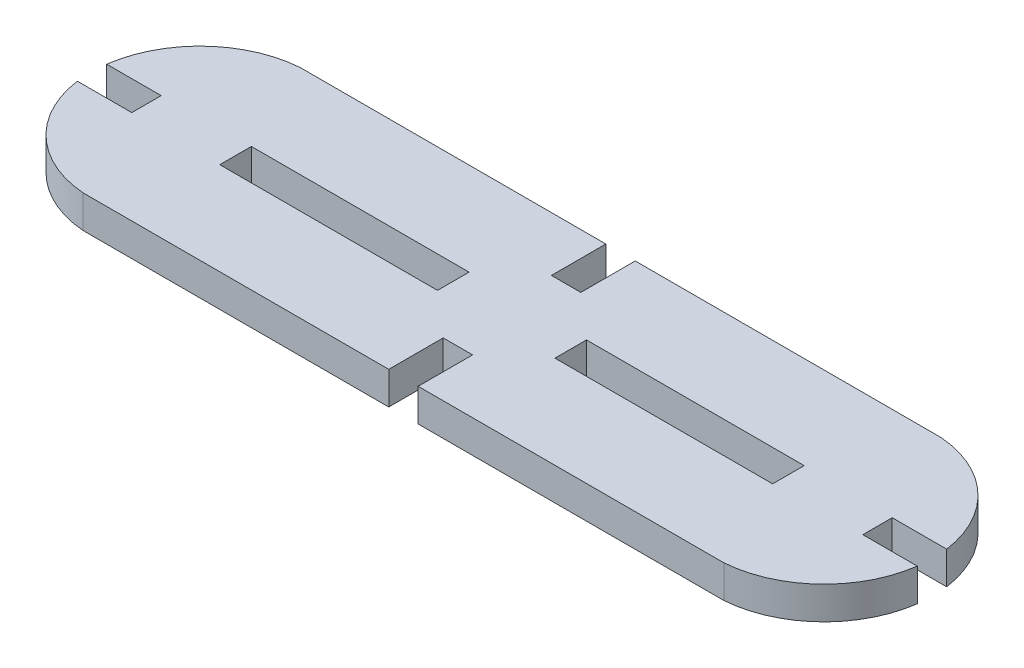
ISO-10303-21;
HEADER;
FILE_DESCRIPTION(('STEP AP214'),'2;1');
FILE_NAME('part.step','',(''),(''),'','','');
FILE_SCHEMA(('AUTOMOTIVE_DESIGN { 1 0 10303 214 1 1 1 1 }'));
ENDSEC;
DATA;
#1=APPLICATION_CONTEXT('core data for automotive mechanical design processes');
#2=APPLICATION_PROTOCOL_DEFINITION('international standard','automotive_design',2000,#1);
#3=PRODUCT_CONTEXT('',#1,'mechanical');
#4=PRODUCT('Part','Part','',(#3));
#5=PRODUCT_RELATED_PRODUCT_CATEGORY('part','',(#4));
#6=PRODUCT_DEFINITION_FORMATION('','',#4);
#7=PRODUCT_DEFINITION_CONTEXT('part definition',#1,'design');
#8=PRODUCT_DEFINITION('design','',#6,#7);
#9=PRODUCT_DEFINITION_SHAPE('','',#8);
#10=(LENGTH_UNIT() NAMED_UNIT(*) SI_UNIT(.MILLI.,.METRE.));
#11=(NAMED_UNIT(*) PLANE_ANGLE_UNIT() SI_UNIT($,.RADIAN.));
#12=(NAMED_UNIT(*) SI_UNIT($,.STERADIAN.) SOLID_ANGLE_UNIT());
#13=UNCERTAINTY_MEASURE_WITH_UNIT(LENGTH_MEASURE(1.E-05),#10,'distance_accuracy_value','');
#14=(GEOMETRIC_REPRESENTATION_CONTEXT(3) GLOBAL_UNCERTAINTY_ASSIGNED_CONTEXT((#13)) GLOBAL_UNIT_ASSIGNED_CONTEXT((#10,
#11,#12)) REPRESENTATION_CONTEXT('',''));
#15=CARTESIAN_POINT('',(0.,0.,0.));
#16=DIRECTION('',(0.,0.,1.));
#17=DIRECTION('',(1.,0.,0.));
#18=AXIS2_PLACEMENT_3D('',#15,#16,#17);
#19=CARTESIAN_POINT('',(8.10539415150254,3.,-20.0294275253098));
#20=DIRECTION('',(0.,-1.,0.));
#21=DIRECTION('',(0.,0.,-1.));
#22=AXIS2_PLACEMENT_3D('',#19,#20,#21);
#23=CYLINDRICAL_SURFACE('',#22,10.);
#24=CARTESIAN_POINT('',(8.10539415150254,0.,-20.0294275253098));
#25=DIRECTION('',(0.,1.,0.));
#26=DIRECTION('',(0.,0.,-1.));
#27=AXIS2_PLACEMENT_3D('',#24,#25,#26);
#28=CIRCLE('',#27,10.);
#29=CARTESIAN_POINT('',(18.0138501361653,0.,-21.3794275253098));
#30=VERTEX_POINT('',#29);
#31=CARTESIAN_POINT('',(8.87199999999997,0.,-30.));
#32=VERTEX_POINT('',#31);
#33=EDGE_CURVE('E227',#30,#32,#28,.T.);
#34=ORIENTED_EDGE('',*,*,#33,.T.);
#35=DIRECTION('',(0.,-1.,0.));
#36=VECTOR('',#35,1.);
#37=CARTESIAN_POINT('',(8.87199999999997,3.,-30.));
#38=LINE('',#37,#36);
#39=CARTESIAN_POINT('',(8.87199999999997,3.,-30.));
#40=VERTEX_POINT('',#39);
#41=EDGE_CURVE('E11',#40,#32,#38,.T.);
#42=ORIENTED_EDGE('',*,*,#41,.F.);
#43=CARTESIAN_POINT('',(8.10539415150254,3.,-20.0294275253098));
#44=DIRECTION('',(0.,1.,0.));
#45=DIRECTION('',(0.,0.,-1.));
#46=AXIS2_PLACEMENT_3D('',#43,#44,#45);
#47=CIRCLE('',#46,10.);
#48=CARTESIAN_POINT('',(18.0138501361653,3.,-21.3794275253098));
#49=VERTEX_POINT('',#48);
#50=EDGE_CURVE('E286',#49,#40,#47,.T.);
#51=ORIENTED_EDGE('',*,*,#50,.F.);
#52=DIRECTION('',(0.,-1.,0.));
#53=VECTOR('',#52,1.);
#54=CARTESIAN_POINT('',(18.0138501361653,3.,-21.3794275253098));
#55=LINE('',#54,#53);
#56=EDGE_CURVE('E328',#49,#30,#55,.T.);
#57=ORIENTED_EDGE('',*,*,#56,.T.);
#58=EDGE_LOOP('',(#34,#42,#51,#57));
#59=FACE_BOUND('',#58,.T.);
#60=ADVANCED_FACE('F32',(#59),#23,.T.);
#61=CARTESIAN_POINT('',(8.87199999999997,3.,-30.));
#62=DIRECTION('',(0.,0.,1.));
#63=DIRECTION('',(1.,0.,0.));
#64=AXIS2_PLACEMENT_3D('',#61,#62,#63);
#65=PLANE('',#64);
#66=DIRECTION('',(-1.,0.,0.));
#67=VECTOR('',#66,1.);
#68=CARTESIAN_POINT('',(8.87199999999997,0.,-30.));
#69=LINE('',#68,#67);
#70=CARTESIAN_POINT('',(-19.214,0.,-30.));
#71=VERTEX_POINT('',#70);
#72=EDGE_CURVE('E331',#32,#71,#69,.T.);
#73=ORIENTED_EDGE('',*,*,#72,.T.);
#74=DIRECTION('',(0.,-1.,0.));
#75=VECTOR('',#74,1.);
#76=CARTESIAN_POINT('',(-19.214,3.,-30.));
#77=LINE('',#76,#75);
#78=CARTESIAN_POINT('',(-19.214,3.,-30.));
#79=VERTEX_POINT('',#78);
#80=EDGE_CURVE('E39',#79,#71,#77,.T.);
#81=ORIENTED_EDGE('',*,*,#80,.F.);
#82=DIRECTION('',(-1.,0.,0.));
#83=VECTOR('',#82,1.);
#84=CARTESIAN_POINT('',(8.87199999999997,3.,-30.));
#85=LINE('',#84,#83);
#86=EDGE_CURVE('E289',#40,#79,#85,.T.);
#87=ORIENTED_EDGE('',*,*,#86,.F.);
#88=ORIENTED_EDGE('',*,*,#41,.T.);
#89=EDGE_LOOP('',(#73,#81,#87,#88));
#90=FACE_BOUND('',#89,.T.);
#91=ADVANCED_FACE('F447',(#90),#65,.F.);
#92=CARTESIAN_POINT('',(-19.214,3.,-25.));
#93=DIRECTION('',(1.,0.,0.));
#94=DIRECTION('',(0.,0.,-1.));
#95=AXIS2_PLACEMENT_3D('',#92,#93,#94);
#96=PLANE('',#95);
#97=DIRECTION('',(0.,0.,1.));
#98=VECTOR('',#97,1.);
#99=CARTESIAN_POINT('',(-19.214,0.,-25.));
#100=LINE('',#99,#98);
#101=CARTESIAN_POINT('',(-19.214,0.,-25.));
#102=VERTEX_POINT('',#101);
#103=EDGE_CURVE('E333',#71,#102,#100,.T.);
#104=ORIENTED_EDGE('',*,*,#103,.T.);
#105=DIRECTION('',(0.,-1.,0.));
#106=VECTOR('',#105,1.);
#107=CARTESIAN_POINT('',(-19.214,3.,-25.));
#108=LINE('',#107,#106);
#109=CARTESIAN_POINT('',(-19.214,3.,-25.));
#110=VERTEX_POINT('',#109);
#111=EDGE_CURVE('E418',#110,#102,#108,.T.);
#112=ORIENTED_EDGE('',*,*,#111,.F.);
#113=DIRECTION('',(0.,0.,1.));
#114=VECTOR('',#113,1.);
#115=CARTESIAN_POINT('',(-19.214,3.,-25.));
#116=LINE('',#115,#114);
#117=EDGE_CURVE('E292',#79,#110,#116,.T.);
#118=ORIENTED_EDGE('',*,*,#117,.F.);
#119=ORIENTED_EDGE('',*,*,#80,.T.);
#120=EDGE_LOOP('',(#104,#112,#118,#119));
#121=FACE_BOUND('',#120,.T.);
#122=ADVANCED_FACE('F425',(#121),#96,.F.);
#123=CARTESIAN_POINT('',(-21.914,3.,-25.));
#124=DIRECTION('',(0.,0.,1.));
#125=DIRECTION('',(1.,0.,0.));
#126=AXIS2_PLACEMENT_3D('',#123,#124,#125);
#127=PLANE('',#126);
#128=DIRECTION('',(-1.,0.,0.));
#129=VECTOR('',#128,1.);
#130=CARTESIAN_POINT('',(-21.914,0.,-25.));
#131=LINE('',#130,#129);
#132=CARTESIAN_POINT('',(-21.914,0.,-25.));
#133=VERTEX_POINT('',#132);
#134=EDGE_CURVE('E335',#102,#133,#131,.T.);
#135=ORIENTED_EDGE('',*,*,#134,.T.);
#136=DIRECTION('',(0.,-1.,0.));
#137=VECTOR('',#136,1.);
#138=CARTESIAN_POINT('',(-21.914,3.,-25.));
#139=LINE('',#138,#137);
#140=CARTESIAN_POINT('',(-21.914,3.,-25.));
#141=VERTEX_POINT('',#140);
#142=EDGE_CURVE('E415',#141,#133,#139,.T.);
#143=ORIENTED_EDGE('',*,*,#142,.F.);
#144=DIRECTION('',(-1.,0.,0.));
#145=VECTOR('',#144,1.);
#146=CARTESIAN_POINT('',(-21.914,3.,-25.));
#147=LINE('',#146,#145);
#148=EDGE_CURVE('E294',#110,#141,#147,.T.);
#149=ORIENTED_EDGE('',*,*,#148,.F.);
#150=ORIENTED_EDGE('',*,*,#111,.T.);
#151=EDGE_LOOP('',(#135,#143,#149,#150));
#152=FACE_BOUND('',#151,.T.);
#153=ADVANCED_FACE('F435',(#152),#127,.F.);
#154=CARTESIAN_POINT('',(-21.914,3.,-30.));
#155=DIRECTION('',(-1.,0.,0.));
#156=DIRECTION('',(0.,0.,1.));
#157=AXIS2_PLACEMENT_3D('',#154,#155,#156);
#158=PLANE('',#157);
#159=DIRECTION('',(0.,0.,-1.));
#160=VECTOR('',#159,1.);
#161=CARTESIAN_POINT('',(-21.914,0.,-30.));
#162=LINE('',#161,#160);
#163=CARTESIAN_POINT('',(-21.914,0.,-30.));
#164=VERTEX_POINT('',#163);
#165=EDGE_CURVE('E337',#133,#164,#162,.T.);
#166=ORIENTED_EDGE('',*,*,#165,.T.);
#167=DIRECTION('',(0.,-1.,0.));
#168=VECTOR('',#167,1.);
#169=CARTESIAN_POINT('',(-21.914,3.,-30.));
#170=LINE('',#169,#168);
#171=CARTESIAN_POINT('',(-21.914,3.,-30.));
#172=VERTEX_POINT('',#171);
#173=EDGE_CURVE('E412',#172,#164,#170,.T.);
#174=ORIENTED_EDGE('',*,*,#173,.F.);
#175=DIRECTION('',(0.,0.,-1.));
#176=VECTOR('',#175,1.);
#177=CARTESIAN_POINT('',(-21.914,3.,-30.));
#178=LINE('',#177,#176);
#179=EDGE_CURVE('E296',#141,#172,#178,.T.);
#180=ORIENTED_EDGE('',*,*,#179,.F.);
#181=ORIENTED_EDGE('',*,*,#142,.T.);
#182=EDGE_LOOP('',(#166,#174,#180,#181));
#183=FACE_BOUND('',#182,.T.);
#184=ADVANCED_FACE('F439',(#183),#158,.F.);
#185=CARTESIAN_POINT('',(-50.,3.,-30.));
#186=DIRECTION('',(0.,0.,1.));
#187=DIRECTION('',(1.,0.,0.));
#188=AXIS2_PLACEMENT_3D('',#185,#186,#187);
#189=PLANE('',#188);
#190=DIRECTION('',(-1.,0.,0.));
#191=VECTOR('',#190,1.);
#192=CARTESIAN_POINT('',(-50.,0.,-30.));
#193=LINE('',#192,#191);
#194=CARTESIAN_POINT('',(-50.,0.,-30.));
#195=VERTEX_POINT('',#194);
#196=EDGE_CURVE('E339',#164,#195,#193,.T.);
#197=ORIENTED_EDGE('',*,*,#196,.T.);
#198=DIRECTION('',(0.,-1.,0.));
#199=VECTOR('',#198,1.);
#200=CARTESIAN_POINT('',(-50.,3.,-30.));
#201=LINE('',#200,#199);
#202=CARTESIAN_POINT('',(-50.,3.,-30.));
#203=VERTEX_POINT('',#202);
#204=EDGE_CURVE('E409',#203,#195,#201,.T.);
#205=ORIENTED_EDGE('',*,*,#204,.F.);
#206=DIRECTION('',(-1.,0.,0.));
#207=VECTOR('',#206,1.);
#208=CARTESIAN_POINT('',(-50.,3.,-30.));
#209=LINE('',#208,#207);
#210=EDGE_CURVE('E298',#172,#203,#209,.T.);
#211=ORIENTED_EDGE('',*,*,#210,.F.);
#212=ORIENTED_EDGE('',*,*,#173,.T.);
#213=EDGE_LOOP('',(#197,#205,#211,#212));
#214=FACE_BOUND('',#213,.T.);
#215=ADVANCED_FACE('F520',(#214),#189,.F.);
#216=CARTESIAN_POINT('',(-49.2333941515026,3.,-20.0294275253098));
#217=DIRECTION('',(0.,-1.,0.));
#218=DIRECTION('',(0.,0.,-1.));
#219=AXIS2_PLACEMENT_3D('',#216,#217,#218);
#220=CYLINDRICAL_SURFACE('',#219,10.);
#221=CARTESIAN_POINT('',(-49.2333941515026,0.,-20.0294275253098));
#222=DIRECTION('',(0.,1.,0.));
#223=DIRECTION('',(0.,0.,1.));
#224=AXIS2_PLACEMENT_3D('',#221,#222,#223);
#225=CIRCLE('',#224,10.);
#226=CARTESIAN_POINT('',(-59.1418501361654,0.,-21.3794275253098));
#227=VERTEX_POINT('',#226);
#228=EDGE_CURVE('E341',#195,#227,#225,.T.);
#229=ORIENTED_EDGE('',*,*,#228,.T.);
#230=DIRECTION('',(0.,-1.,0.));
#231=VECTOR('',#230,1.);
#232=CARTESIAN_POINT('',(-59.1418501361654,3.,-21.3794275253098));
#233=LINE('',#232,#231);
#234=CARTESIAN_POINT('',(-59.1418501361654,3.,-21.3794275253098));
#235=VERTEX_POINT('',#234);
#236=EDGE_CURVE('E406',#235,#227,#233,.T.);
#237=ORIENTED_EDGE('',*,*,#236,.F.);
#238=CARTESIAN_POINT('',(-49.2333941515026,3.,-20.0294275253098));
#239=DIRECTION('',(0.,1.,0.));
#240=DIRECTION('',(0.,0.,1.));
#241=AXIS2_PLACEMENT_3D('',#238,#239,#240);
#242=CIRCLE('',#241,10.);
#243=EDGE_CURVE('E300',#203,#235,#242,.T.);
#244=ORIENTED_EDGE('',*,*,#243,.F.);
#245=ORIENTED_EDGE('',*,*,#204,.T.);
#246=EDGE_LOOP('',(#229,#237,#244,#245));
#247=FACE_BOUND('',#246,.T.);
#248=ADVANCED_FACE('F518',(#247),#220,.T.);
#249=CARTESIAN_POINT('',(-54.1418501361654,3.,-21.3794275253098));
#250=DIRECTION('',(0.,0.,-1.));
#251=DIRECTION('',(-1.,0.,0.));
#252=AXIS2_PLACEMENT_3D('',#249,#250,#251);
#253=PLANE('',#252);
#254=DIRECTION('',(1.,0.,0.));
#255=VECTOR('',#254,1.);
#256=CARTESIAN_POINT('',(-54.1418501361654,0.,-21.3794275253098));
#257=LINE('',#256,#255);
#258=CARTESIAN_POINT('',(-54.1418501361654,0.,-21.3794275253098));
#259=VERTEX_POINT('',#258);
#260=EDGE_CURVE('E343',#227,#259,#257,.T.);
#261=ORIENTED_EDGE('',*,*,#260,.T.);
#262=DIRECTION('',(0.,-1.,0.));
#263=VECTOR('',#262,1.);
#264=CARTESIAN_POINT('',(-54.1418501361654,3.,-21.3794275253098));
#265=LINE('',#264,#263);
#266=CARTESIAN_POINT('',(-54.1418501361654,3.,-21.3794275253098));
#267=VERTEX_POINT('',#266);
#268=EDGE_CURVE('E403',#267,#259,#265,.T.);
#269=ORIENTED_EDGE('',*,*,#268,.F.);
#270=DIRECTION('',(1.,0.,0.));
#271=VECTOR('',#270,1.);
#272=CARTESIAN_POINT('',(-54.1418501361654,3.,-21.3794275253098));
#273=LINE('',#272,#271);
#274=EDGE_CURVE('E302',#235,#267,#273,.T.);
#275=ORIENTED_EDGE('',*,*,#274,.F.);
#276=ORIENTED_EDGE('',*,*,#236,.T.);
#277=EDGE_LOOP('',(#261,#269,#275,#276));
#278=FACE_BOUND('',#277,.T.);
#279=ADVANCED_FACE('F513',(#278),#253,.F.);
#280=CARTESIAN_POINT('',(-54.1418501361654,3.,-18.6794275253098));
#281=DIRECTION('',(1.,0.,0.));
#282=DIRECTION('',(0.,0.,-1.));
#283=AXIS2_PLACEMENT_3D('',#280,#281,#282);
#284=PLANE('',#283);
#285=DIRECTION('',(0.,0.,1.));
#286=VECTOR('',#285,1.);
#287=CARTESIAN_POINT('',(-54.1418501361654,0.,-18.6794275253098));
#288=LINE('',#287,#286);
#289=CARTESIAN_POINT('',(-54.1418501361654,0.,-18.6794275253098));
#290=VERTEX_POINT('',#289);
#291=EDGE_CURVE('E345',#259,#290,#288,.T.);
#292=ORIENTED_EDGE('',*,*,#291,.T.);
#293=DIRECTION('',(0.,-1.,0.));
#294=VECTOR('',#293,1.);
#295=CARTESIAN_POINT('',(-54.1418501361654,3.,-18.6794275253098));
#296=LINE('',#295,#294);
#297=CARTESIAN_POINT('',(-54.1418501361654,3.,-18.6794275253098));
#298=VERTEX_POINT('',#297);
#299=EDGE_CURVE('E400',#298,#290,#296,.T.);
#300=ORIENTED_EDGE('',*,*,#299,.F.);
#301=DIRECTION('',(0.,0.,1.));
#302=VECTOR('',#301,1.);
#303=CARTESIAN_POINT('',(-54.1418501361654,3.,-18.6794275253098));
#304=LINE('',#303,#302);
#305=EDGE_CURVE('E304',#267,#298,#304,.T.);
#306=ORIENTED_EDGE('',*,*,#305,.F.);
#307=ORIENTED_EDGE('',*,*,#268,.T.);
#308=EDGE_LOOP('',(#292,#300,#306,#307));
#309=FACE_BOUND('',#308,.T.);
#310=ADVANCED_FACE('F508',(#309),#284,.F.);
#311=CARTESIAN_POINT('',(-54.1418501361654,3.,-18.6794275253098));
#312=DIRECTION('',(0.,0.,1.));
#313=DIRECTION('',(1.,0.,0.));
#314=AXIS2_PLACEMENT_3D('',#311,#312,#313);
#315=PLANE('',#314);
#316=DIRECTION('',(-1.,0.,0.));
#317=VECTOR('',#316,1.);
#318=CARTESIAN_POINT('',(-54.1418501361654,0.,-18.6794275253098));
#319=LINE('',#318,#317);
#320=CARTESIAN_POINT('',(-59.1418501361654,0.,-18.6794275253098));
#321=VERTEX_POINT('',#320);
#322=EDGE_CURVE('E347',#290,#321,#319,.T.);
#323=ORIENTED_EDGE('',*,*,#322,.T.);
#324=DIRECTION('',(0.,-1.,0.));
#325=VECTOR('',#324,1.);
#326=CARTESIAN_POINT('',(-59.1418501361654,3.,-18.6794275253098));
#327=LINE('',#326,#325);
#328=CARTESIAN_POINT('',(-59.1418501361654,3.,-18.6794275253098));
#329=VERTEX_POINT('',#328);
#330=EDGE_CURVE('E397',#329,#321,#327,.T.);
#331=ORIENTED_EDGE('',*,*,#330,.F.);
#332=DIRECTION('',(-1.,0.,0.));
#333=VECTOR('',#332,1.);
#334=CARTESIAN_POINT('',(-54.1418501361654,3.,-18.6794275253098));
#335=LINE('',#334,#333);
#336=EDGE_CURVE('E306',#298,#329,#335,.T.);
#337=ORIENTED_EDGE('',*,*,#336,.F.);
#338=ORIENTED_EDGE('',*,*,#299,.T.);
#339=EDGE_LOOP('',(#323,#331,#337,#338));
#340=FACE_BOUND('',#339,.T.);
#341=ADVANCED_FACE('F504',(#340),#315,.F.);
#342=CARTESIAN_POINT('',(-49.2333941515026,3.,-20.0294275253098));
#343=DIRECTION('',(0.,-1.,0.));
#344=DIRECTION('',(0.,0.,-1.));
#345=AXIS2_PLACEMENT_3D('',#342,#343,#344);
#346=CYLINDRICAL_SURFACE('',#345,10.);
#347=CARTESIAN_POINT('',(-49.2333941515026,0.,-20.0294275253098));
#348=DIRECTION('',(0.,1.,0.));
#349=DIRECTION('',(0.,0.,-1.));
#350=AXIS2_PLACEMENT_3D('',#347,#348,#349);
#351=CIRCLE('',#350,10.);
#352=CARTESIAN_POINT('',(-50.,0.,-10.0588550506196));
#353=VERTEX_POINT('',#352);
#354=EDGE_CURVE('E349',#321,#353,#351,.T.);
#355=ORIENTED_EDGE('',*,*,#354,.T.);
#356=DIRECTION('',(0.,-1.,0.));
#357=VECTOR('',#356,1.);
#358=CARTESIAN_POINT('',(-50.,3.,-10.0588550506196));
#359=LINE('',#358,#357);
#360=CARTESIAN_POINT('',(-50.,3.,-10.0588550506196));
#361=VERTEX_POINT('',#360);
#362=EDGE_CURVE('E394',#361,#353,#359,.T.);
#363=ORIENTED_EDGE('',*,*,#362,.F.);
#364=CARTESIAN_POINT('',(-49.2333941515026,3.,-20.0294275253098));
#365=DIRECTION('',(0.,1.,0.));
#366=DIRECTION('',(0.,0.,-1.));
#367=AXIS2_PLACEMENT_3D('',#364,#365,#366);
#368=CIRCLE('',#367,10.);
#369=EDGE_CURVE('E308',#329,#361,#368,.T.);
#370=ORIENTED_EDGE('',*,*,#369,.F.);
#371=ORIENTED_EDGE('',*,*,#330,.T.);
#372=EDGE_LOOP('',(#355,#363,#370,#371));
#373=FACE_BOUND('',#372,.T.);
#374=ADVANCED_FACE('F499',(#373),#346,.T.);
#375=CARTESIAN_POINT('',(-50.,3.,-10.0588550506196));
#376=DIRECTION('',(0.,0.,-1.));
#377=DIRECTION('',(-1.,0.,0.));
#378=AXIS2_PLACEMENT_3D('',#375,#376,#377);
#379=PLANE('',#378);
#380=DIRECTION('',(1.,0.,0.));
#381=VECTOR('',#380,1.);
#382=CARTESIAN_POINT('',(-50.,0.,-10.0588550506196));
#383=LINE('',#382,#381);
#384=CARTESIAN_POINT('',(-21.914,0.,-10.0588550506196));
#385=VERTEX_POINT('',#384);
#386=EDGE_CURVE('E351',#353,#385,#383,.T.);
#387=ORIENTED_EDGE('',*,*,#386,.T.);
#388=DIRECTION('',(0.,-1.,0.));
#389=VECTOR('',#388,1.);
#390=CARTESIAN_POINT('',(-21.914,3.,-10.0588550506196));
#391=LINE('',#390,#389);
#392=CARTESIAN_POINT('',(-21.914,3.,-10.0588550506196));
#393=VERTEX_POINT('',#392);
#394=EDGE_CURVE('E391',#393,#385,#391,.T.);
#395=ORIENTED_EDGE('',*,*,#394,.F.);
#396=DIRECTION('',(1.,0.,0.));
#397=VECTOR('',#396,1.);
#398=CARTESIAN_POINT('',(-50.,3.,-10.0588550506196));
#399=LINE('',#398,#397);
#400=EDGE_CURVE('E310',#361,#393,#399,.T.);
#401=ORIENTED_EDGE('',*,*,#400,.F.);
#402=ORIENTED_EDGE('',*,*,#362,.T.);
#403=EDGE_LOOP('',(#387,#395,#401,#402));
#404=FACE_BOUND('',#403,.T.);
#405=ADVANCED_FACE('F493',(#404),#379,.F.);
#406=CARTESIAN_POINT('',(-21.914,3.,-10.0588550506196));
#407=DIRECTION('',(-1.,0.,0.));
#408=DIRECTION('',(0.,0.,1.));
#409=AXIS2_PLACEMENT_3D('',#406,#407,#408);
#410=PLANE('',#409);
#411=DIRECTION('',(0.,0.,-1.));
#412=VECTOR('',#411,1.);
#413=CARTESIAN_POINT('',(-21.914,0.,-10.0588550506196));
#414=LINE('',#413,#412);
#415=CARTESIAN_POINT('',(-21.914,0.,-15.0588550506196));
#416=VERTEX_POINT('',#415);
#417=EDGE_CURVE('E353',#385,#416,#414,.T.);
#418=ORIENTED_EDGE('',*,*,#417,.T.);
#419=DIRECTION('',(0.,-1.,0.));
#420=VECTOR('',#419,1.);
#421=CARTESIAN_POINT('',(-21.914,3.,-15.0588550506196));
#422=LINE('',#421,#420);
#423=CARTESIAN_POINT('',(-21.914,3.,-15.0588550506196));
#424=VERTEX_POINT('',#423);
#425=EDGE_CURVE('E388',#424,#416,#422,.T.);
#426=ORIENTED_EDGE('',*,*,#425,.F.);
#427=DIRECTION('',(0.,0.,-1.));
#428=VECTOR('',#427,1.);
#429=CARTESIAN_POINT('',(-21.914,3.,-10.0588550506196));
#430=LINE('',#429,#428);
#431=EDGE_CURVE('E312',#393,#424,#430,.T.);
#432=ORIENTED_EDGE('',*,*,#431,.F.);
#433=ORIENTED_EDGE('',*,*,#394,.T.);
#434=EDGE_LOOP('',(#418,#426,#432,#433));
#435=FACE_BOUND('',#434,.T.);
#436=ADVANCED_FACE('F489',(#435),#410,.F.);
#437=CARTESIAN_POINT('',(-21.914,3.,-15.0588550506196));
#438=DIRECTION('',(0.,0.,-1.));
#439=DIRECTION('',(-1.,0.,0.));
#440=AXIS2_PLACEMENT_3D('',#437,#438,#439);
#441=PLANE('',#440);
#442=DIRECTION('',(1.,0.,0.));
#443=VECTOR('',#442,1.);
#444=CARTESIAN_POINT('',(-21.914,0.,-15.0588550506196));
#445=LINE('',#444,#443);
#446=CARTESIAN_POINT('',(-19.214,0.,-15.0588550506196));
#447=VERTEX_POINT('',#446);
#448=EDGE_CURVE('E355',#416,#447,#445,.T.);
#449=ORIENTED_EDGE('',*,*,#448,.T.);
#450=DIRECTION('',(0.,-1.,0.));
#451=VECTOR('',#450,1.);
#452=CARTESIAN_POINT('',(-19.214,3.,-15.0588550506196));
#453=LINE('',#452,#451);
#454=CARTESIAN_POINT('',(-19.214,3.,-15.0588550506196));
#455=VERTEX_POINT('',#454);
#456=EDGE_CURVE('E385',#455,#447,#453,.T.);
#457=ORIENTED_EDGE('',*,*,#456,.F.);
#458=DIRECTION('',(1.,0.,0.));
#459=VECTOR('',#458,1.);
#460=CARTESIAN_POINT('',(-21.914,3.,-15.0588550506196));
#461=LINE('',#460,#459);
#462=EDGE_CURVE('E314',#424,#455,#461,.T.);
#463=ORIENTED_EDGE('',*,*,#462,.F.);
#464=ORIENTED_EDGE('',*,*,#425,.T.);
#465=EDGE_LOOP('',(#449,#457,#463,#464));
#466=FACE_BOUND('',#465,.T.);
#467=ADVANCED_FACE('F484',(#466),#441,.F.);
#468=CARTESIAN_POINT('',(-19.214,3.,-15.0588550506196));
#469=DIRECTION('',(1.,0.,0.));
#470=DIRECTION('',(0.,0.,-1.));
#471=AXIS2_PLACEMENT_3D('',#468,#469,#470);
#472=PLANE('',#471);
#473=DIRECTION('',(0.,0.,1.));
#474=VECTOR('',#473,1.);
#475=CARTESIAN_POINT('',(-19.214,0.,-15.0588550506196));
#476=LINE('',#475,#474);
#477=CARTESIAN_POINT('',(-19.214,0.,-10.0588550506196));
#478=VERTEX_POINT('',#477);
#479=EDGE_CURVE('E357',#447,#478,#476,.T.);
#480=ORIENTED_EDGE('',*,*,#479,.T.);
#481=DIRECTION('',(0.,-1.,0.));
#482=VECTOR('',#481,1.);
#483=CARTESIAN_POINT('',(-19.214,3.,-10.0588550506196));
#484=LINE('',#483,#482);
#485=CARTESIAN_POINT('',(-19.214,3.,-10.0588550506196));
#486=VERTEX_POINT('',#485);
#487=EDGE_CURVE('E382',#486,#478,#484,.T.);
#488=ORIENTED_EDGE('',*,*,#487,.F.);
#489=DIRECTION('',(0.,0.,1.));
#490=VECTOR('',#489,1.);
#491=CARTESIAN_POINT('',(-19.214,3.,-15.0588550506196));
#492=LINE('',#491,#490);
#493=EDGE_CURVE('E316',#455,#486,#492,.T.);
#494=ORIENTED_EDGE('',*,*,#493,.F.);
#495=ORIENTED_EDGE('',*,*,#456,.T.);
#496=EDGE_LOOP('',(#480,#488,#494,#495));
#497=FACE_BOUND('',#496,.T.);
#498=ADVANCED_FACE('F478',(#497),#472,.F.);
#499=CARTESIAN_POINT('',(8.87199999999997,3.,-10.0588550506196));
#500=DIRECTION('',(0.,0.,-1.));
#501=DIRECTION('',(-1.,0.,0.));
#502=AXIS2_PLACEMENT_3D('',#499,#500,#501);
#503=PLANE('',#502);
#504=DIRECTION('',(1.,0.,0.));
#505=VECTOR('',#504,1.);
#506=CARTESIAN_POINT('',(8.87199999999997,0.,-10.0588550506196));
#507=LINE('',#506,#505);
#508=CARTESIAN_POINT('',(8.87199999999997,0.,-10.0588550506196));
#509=VERTEX_POINT('',#508);
#510=EDGE_CURVE('E359',#478,#509,#507,.T.);
#511=ORIENTED_EDGE('',*,*,#510,.T.);
#512=DIRECTION('',(0.,-1.,0.));
#513=VECTOR('',#512,1.);
#514=CARTESIAN_POINT('',(8.87199999999997,3.,-10.0588550506196));
#515=LINE('',#514,#513);
#516=CARTESIAN_POINT('',(8.87199999999997,3.,-10.0588550506196));
#517=VERTEX_POINT('',#516);
#518=EDGE_CURVE('E379',#517,#509,#515,.T.);
#519=ORIENTED_EDGE('',*,*,#518,.F.);
#520=DIRECTION('',(1.,0.,0.));
#521=VECTOR('',#520,1.);
#522=CARTESIAN_POINT('',(8.87199999999997,3.,-10.0588550506196));
#523=LINE('',#522,#521);
#524=EDGE_CURVE('E318',#486,#517,#523,.T.);
#525=ORIENTED_EDGE('',*,*,#524,.F.);
#526=ORIENTED_EDGE('',*,*,#487,.T.);
#527=EDGE_LOOP('',(#511,#519,#525,#526));
#528=FACE_BOUND('',#527,.T.);
#529=ADVANCED_FACE('F474',(#528),#503,.F.);
#530=CARTESIAN_POINT('',(8.10539415150254,3.,-20.0294275253098));
#531=DIRECTION('',(0.,-1.,0.));
#532=DIRECTION('',(0.,0.,-1.));
#533=AXIS2_PLACEMENT_3D('',#530,#531,#532);
#534=CYLINDRICAL_SURFACE('',#533,10.);
#535=CARTESIAN_POINT('',(8.10539415150254,0.,-20.0294275253098));
#536=DIRECTION('',(0.,1.,0.));
#537=DIRECTION('',(0.,0.,1.));
#538=AXIS2_PLACEMENT_3D('',#535,#536,#537);
#539=CIRCLE('',#538,10.);
#540=CARTESIAN_POINT('',(18.0138501361653,0.,-18.6794275253098));
#541=VERTEX_POINT('',#540);
#542=EDGE_CURVE('E361',#509,#541,#539,.T.);
#543=ORIENTED_EDGE('',*,*,#542,.T.);
#544=DIRECTION('',(0.,-1.,0.));
#545=VECTOR('',#544,1.);
#546=CARTESIAN_POINT('',(18.0138501361653,3.,-18.6794275253098));
#547=LINE('',#546,#545);
#548=CARTESIAN_POINT('',(18.0138501361653,3.,-18.6794275253098));
#549=VERTEX_POINT('',#548);
#550=EDGE_CURVE('E376',#549,#541,#547,.T.);
#551=ORIENTED_EDGE('',*,*,#550,.F.);
#552=CARTESIAN_POINT('',(8.10539415150254,3.,-20.0294275253098));
#553=DIRECTION('',(0.,1.,0.));
#554=DIRECTION('',(0.,0.,1.));
#555=AXIS2_PLACEMENT_3D('',#552,#553,#554);
#556=CIRCLE('',#555,10.);
#557=EDGE_CURVE('E320',#517,#549,#556,.T.);
#558=ORIENTED_EDGE('',*,*,#557,.F.);
#559=ORIENTED_EDGE('',*,*,#518,.T.);
#560=EDGE_LOOP('',(#543,#551,#558,#559));
#561=FACE_BOUND('',#560,.T.);
#562=ADVANCED_FACE('F469',(#561),#534,.T.);
#563=CARTESIAN_POINT('',(13.0138501361653,3.,-18.6794275253098));
#564=DIRECTION('',(0.,0.,1.));
#565=DIRECTION('',(1.,0.,0.));
#566=AXIS2_PLACEMENT_3D('',#563,#564,#565);
#567=PLANE('',#566);
#568=DIRECTION('',(-1.,0.,0.));
#569=VECTOR('',#568,1.);
#570=CARTESIAN_POINT('',(13.0138501361653,0.,-18.6794275253098));
#571=LINE('',#570,#569);
#572=CARTESIAN_POINT('',(13.0138501361653,0.,-18.6794275253098));
#573=VERTEX_POINT('',#572);
#574=EDGE_CURVE('E363',#541,#573,#571,.T.);
#575=ORIENTED_EDGE('',*,*,#574,.T.);
#576=DIRECTION('',(0.,-1.,0.));
#577=VECTOR('',#576,1.);
#578=CARTESIAN_POINT('',(13.0138501361653,3.,-18.6794275253098));
#579=LINE('',#578,#577);
#580=CARTESIAN_POINT('',(13.0138501361653,3.,-18.6794275253098));
#581=VERTEX_POINT('',#580);
#582=EDGE_CURVE('E373',#581,#573,#579,.T.);
#583=ORIENTED_EDGE('',*,*,#582,.F.);
#584=DIRECTION('',(-1.,0.,0.));
#585=VECTOR('',#584,1.);
#586=CARTESIAN_POINT('',(13.0138501361653,3.,-18.6794275253098));
#587=LINE('',#586,#585);
#588=EDGE_CURVE('E322',#549,#581,#587,.T.);
#589=ORIENTED_EDGE('',*,*,#588,.F.);
#590=ORIENTED_EDGE('',*,*,#550,.T.);
#591=EDGE_LOOP('',(#575,#583,#589,#590));
#592=FACE_BOUND('',#591,.T.);
#593=ADVANCED_FACE('F463',(#592),#567,.F.);
#594=CARTESIAN_POINT('',(13.0138501361653,3.,-18.6794275253098));
#595=DIRECTION('',(-1.,0.,0.));
#596=DIRECTION('',(0.,0.,1.));
#597=AXIS2_PLACEMENT_3D('',#594,#595,#596);
#598=PLANE('',#597);
#599=DIRECTION('',(0.,0.,-1.));
#600=VECTOR('',#599,1.);
#601=CARTESIAN_POINT('',(13.0138501361653,0.,-18.6794275253098));
#602=LINE('',#601,#600);
#603=CARTESIAN_POINT('',(13.0138501361653,0.,-21.3794275253098));
#604=VERTEX_POINT('',#603);
#605=EDGE_CURVE('E365',#573,#604,#602,.T.);
#606=ORIENTED_EDGE('',*,*,#605,.T.);
#607=DIRECTION('',(0.,-1.,0.));
#608=VECTOR('',#607,1.);
#609=CARTESIAN_POINT('',(13.0138501361653,3.,-21.3794275253098));
#610=LINE('',#609,#608);
#611=CARTESIAN_POINT('',(13.0138501361653,3.,-21.3794275253098));
#612=VERTEX_POINT('',#611);
#613=EDGE_CURVE('E370',#612,#604,#610,.T.);
#614=ORIENTED_EDGE('',*,*,#613,.F.);
#615=DIRECTION('',(0.,0.,-1.));
#616=VECTOR('',#615,1.);
#617=CARTESIAN_POINT('',(13.0138501361653,3.,-18.6794275253098));
#618=LINE('',#617,#616);
#619=EDGE_CURVE('E324',#581,#612,#618,.T.);
#620=ORIENTED_EDGE('',*,*,#619,.F.);
#621=ORIENTED_EDGE('',*,*,#582,.T.);
#622=EDGE_LOOP('',(#606,#614,#620,#621));
#623=FACE_BOUND('',#622,.T.);
#624=ADVANCED_FACE('F459',(#623),#598,.F.);
#625=CARTESIAN_POINT('',(13.0138501361653,3.,-21.3794275253098));
#626=DIRECTION('',(0.,0.,-1.));
#627=DIRECTION('',(-1.,0.,0.));
#628=AXIS2_PLACEMENT_3D('',#625,#626,#627);
#629=PLANE('',#628);
#630=DIRECTION('',(1.,0.,0.));
#631=VECTOR('',#630,1.);
#632=CARTESIAN_POINT('',(13.0138501361653,0.,-21.3794275253098));
#633=LINE('',#632,#631);
#634=EDGE_CURVE('E290',#604,#30,#633,.T.);
#635=ORIENTED_EDGE('',*,*,#634,.T.);
#636=ORIENTED_EDGE('',*,*,#56,.F.);
#637=DIRECTION('',(1.,0.,0.));
#638=VECTOR('',#637,1.);
#639=CARTESIAN_POINT('',(13.0138501361653,3.,-21.3794275253098));
#640=LINE('',#639,#638);
#641=EDGE_CURVE('E326',#612,#49,#640,.T.);
#642=ORIENTED_EDGE('',*,*,#641,.F.);
#643=ORIENTED_EDGE('',*,*,#613,.T.);
#644=EDGE_LOOP('',(#635,#636,#642,#643));
#645=FACE_BOUND('',#644,.T.);
#646=ADVANCED_FACE('F454',(#645),#629,.F.);
#647=CARTESIAN_POINT('',(8.10539415150254,3.,-20.0294275253098));
#648=DIRECTION('',(0.,-1.,0.));
#649=DIRECTION('',(0.,0.,-1.));
#650=AXIS2_PLACEMENT_3D('',#647,#648,#649);
#651=PLANE('',#650);
#652=DIRECTION('',(-1.,0.,0.));
#653=VECTOR('',#652,1.);
#654=CARTESIAN_POINT('',(-45.957,3.,-21.4794275253098));
#655=LINE('',#654,#653);
#656=CARTESIAN_POINT('',(-25.957,3.,-21.4794275253098));
#657=VERTEX_POINT('',#656);
#658=CARTESIAN_POINT('',(-45.957,3.,-21.4794275253098));
#659=VERTEX_POINT('',#658);
#660=EDGE_CURVE('E240',#657,#659,#655,.T.);
#661=ORIENTED_EDGE('',*,*,#660,.F.);
#662=DIRECTION('',(0.,0.,-1.));
#663=VECTOR('',#662,1.);
#664=CARTESIAN_POINT('',(-25.957,3.,-18.5794275253098));
#665=LINE('',#664,#663);
#666=CARTESIAN_POINT('',(-25.957,3.,-18.5794275253098));
#667=VERTEX_POINT('',#666);
#668=EDGE_CURVE('E46',#667,#657,#665,.T.);
#669=ORIENTED_EDGE('',*,*,#668,.F.);
#670=DIRECTION('',(1.,0.,0.));
#671=VECTOR('',#670,1.);
#672=CARTESIAN_POINT('',(-45.957,3.,-18.5794275253098));
#673=LINE('',#672,#671);
#674=CARTESIAN_POINT('',(-45.957,3.,-18.5794275253098));
#675=VERTEX_POINT('',#674);
#676=EDGE_CURVE('E233',#675,#667,#673,.T.);
#677=ORIENTED_EDGE('',*,*,#676,.F.);
#678=DIRECTION('',(0.,0.,1.));
#679=VECTOR('',#678,1.);
#680=CARTESIAN_POINT('',(-45.957,3.,-18.5794275253098));
#681=LINE('',#680,#679);
#682=EDGE_CURVE('E247',#659,#675,#681,.T.);
#683=ORIENTED_EDGE('',*,*,#682,.F.);
#684=EDGE_LOOP('',(#661,#669,#677,#683));
#685=FACE_BOUND('',#684,.T.);
#686=DIRECTION('',(-1.,0.,0.));
#687=VECTOR('',#686,1.);
#688=CARTESIAN_POINT('',(-15.171,3.,-21.4794275253098));
#689=LINE('',#688,#687);
#690=CARTESIAN_POINT('',(4.82899999999998,3.,-21.4794275253098));
#691=VERTEX_POINT('',#690);
#692=CARTESIAN_POINT('',(-15.171,3.,-21.4794275253098));
#693=VERTEX_POINT('',#692);
#694=EDGE_CURVE('E266',#691,#693,#689,.T.);
#695=ORIENTED_EDGE('',*,*,#694,.F.);
#696=DIRECTION('',(0.,0.,-1.));
#697=VECTOR('',#696,1.);
#698=CARTESIAN_POINT('',(4.82899999999998,3.,-18.5794275253098));
#699=LINE('',#698,#697);
#700=CARTESIAN_POINT('',(4.82899999999998,3.,-18.5794275253098));
#701=VERTEX_POINT('',#700);
#702=EDGE_CURVE('E54',#701,#691,#699,.T.);
#703=ORIENTED_EDGE('',*,*,#702,.F.);
#704=DIRECTION('',(1.,0.,0.));
#705=VECTOR('',#704,1.);
#706=CARTESIAN_POINT('',(-15.171,3.,-18.5794275253098));
#707=LINE('',#706,#705);
#708=CARTESIAN_POINT('',(-15.171,3.,-18.5794275253098));
#709=VERTEX_POINT('',#708);
#710=EDGE_CURVE('E272',#709,#701,#707,.T.);
#711=ORIENTED_EDGE('',*,*,#710,.F.);
#712=DIRECTION('',(0.,0.,1.));
#713=VECTOR('',#712,1.);
#714=CARTESIAN_POINT('',(-15.171,3.,-18.5794275253098));
#715=LINE('',#714,#713);
#716=EDGE_CURVE('E269',#693,#709,#715,.T.);
#717=ORIENTED_EDGE('',*,*,#716,.F.);
#718=EDGE_LOOP('',(#695,#703,#711,#717));
#719=FACE_BOUND('',#718,.T.);
#720=ORIENTED_EDGE('',*,*,#50,.T.);
#721=ORIENTED_EDGE('',*,*,#86,.T.);
#722=ORIENTED_EDGE('',*,*,#117,.T.);
#723=ORIENTED_EDGE('',*,*,#148,.T.);
#724=ORIENTED_EDGE('',*,*,#179,.T.);
#725=ORIENTED_EDGE('',*,*,#210,.T.);
#726=ORIENTED_EDGE('',*,*,#243,.T.);
#727=ORIENTED_EDGE('',*,*,#274,.T.);
#728=ORIENTED_EDGE('',*,*,#305,.T.);
#729=ORIENTED_EDGE('',*,*,#336,.T.);
#730=ORIENTED_EDGE('',*,*,#369,.T.);
#731=ORIENTED_EDGE('',*,*,#400,.T.);
#732=ORIENTED_EDGE('',*,*,#431,.T.);
#733=ORIENTED_EDGE('',*,*,#462,.T.);
#734=ORIENTED_EDGE('',*,*,#493,.T.);
#735=ORIENTED_EDGE('',*,*,#524,.T.);
#736=ORIENTED_EDGE('',*,*,#557,.T.);
#737=ORIENTED_EDGE('',*,*,#588,.T.);
#738=ORIENTED_EDGE('',*,*,#619,.T.);
#739=ORIENTED_EDGE('',*,*,#641,.T.);
#740=EDGE_LOOP('',(#720,#721,#722,#723,#724,#725,#726,#727,#728,#729,#730,#731,#732,#733,#734,
#735,#736,#737,#738,#739));
#741=FACE_BOUND('',#740,.T.);
#742=ADVANCED_FACE('F443',(#685,#719,#741),#651,.F.);
#743=CARTESIAN_POINT('',(8.10539415150254,0.,-20.0294275253098));
#744=DIRECTION('',(0.,-1.,0.));
#745=DIRECTION('',(0.,0.,-1.));
#746=AXIS2_PLACEMENT_3D('',#743,#744,#745);
#747=PLANE('',#746);
#748=DIRECTION('',(0.,0.,-1.));
#749=VECTOR('',#748,1.);
#750=CARTESIAN_POINT('',(-25.957,0.,-18.5794275253098));
#751=LINE('',#750,#749);
#752=CARTESIAN_POINT('',(-25.957,0.,-18.5794275253098));
#753=VERTEX_POINT('',#752);
#754=CARTESIAN_POINT('',(-25.957,0.,-21.4794275253098));
#755=VERTEX_POINT('',#754);
#756=EDGE_CURVE('E231',#753,#755,#751,.T.);
#757=ORIENTED_EDGE('',*,*,#756,.T.);
#758=DIRECTION('',(-1.,0.,0.));
#759=VECTOR('',#758,1.);
#760=CARTESIAN_POINT('',(-45.957,0.,-21.4794275253098));
#761=LINE('',#760,#759);
#762=CARTESIAN_POINT('',(-45.957,0.,-21.4794275253098));
#763=VERTEX_POINT('',#762);
#764=EDGE_CURVE('E217',#755,#763,#761,.T.);
#765=ORIENTED_EDGE('',*,*,#764,.T.);
#766=DIRECTION('',(0.,0.,1.));
#767=VECTOR('',#766,1.);
#768=CARTESIAN_POINT('',(-45.957,0.,-18.5794275253098));
#769=LINE('',#768,#767);
#770=CARTESIAN_POINT('',(-45.957,0.,-18.5794275253098));
#771=VERTEX_POINT('',#770);
#772=EDGE_CURVE('E242',#763,#771,#769,.T.);
#773=ORIENTED_EDGE('',*,*,#772,.T.);
#774=DIRECTION('',(1.,0.,0.));
#775=VECTOR('',#774,1.);
#776=CARTESIAN_POINT('',(-45.957,0.,-18.5794275253098));
#777=LINE('',#776,#775);
#778=EDGE_CURVE('E238',#771,#753,#777,.T.);
#779=ORIENTED_EDGE('',*,*,#778,.T.);
#780=EDGE_LOOP('',(#757,#765,#773,#779));
#781=FACE_BOUND('',#780,.T.);
#782=DIRECTION('',(0.,0.,-1.));
#783=VECTOR('',#782,1.);
#784=CARTESIAN_POINT('',(4.82899999999998,0.,-18.5794275253098));
#785=LINE('',#784,#783);
#786=CARTESIAN_POINT('',(4.82899999999998,0.,-18.5794275253098));
#787=VERTEX_POINT('',#786);
#788=CARTESIAN_POINT('',(4.82899999999998,0.,-21.4794275253098));
#789=VERTEX_POINT('',#788);
#790=EDGE_CURVE('E262',#787,#789,#785,.T.);
#791=ORIENTED_EDGE('',*,*,#790,.T.);
#792=DIRECTION('',(-1.,0.,0.));
#793=VECTOR('',#792,1.);
#794=CARTESIAN_POINT('',(-15.171,0.,-21.4794275253098));
#795=LINE('',#794,#793);
#796=CARTESIAN_POINT('',(-15.171,0.,-21.4794275253098));
#797=VERTEX_POINT('',#796);
#798=EDGE_CURVE('E278',#789,#797,#795,.T.);
#799=ORIENTED_EDGE('',*,*,#798,.T.);
#800=DIRECTION('',(0.,0.,1.));
#801=VECTOR('',#800,1.);
#802=CARTESIAN_POINT('',(-15.171,0.,-18.5794275253098));
#803=LINE('',#802,#801);
#804=CARTESIAN_POINT('',(-15.171,0.,-18.5794275253098));
#805=VERTEX_POINT('',#804);
#806=EDGE_CURVE('E256',#797,#805,#803,.T.);
#807=ORIENTED_EDGE('',*,*,#806,.T.);
#808=DIRECTION('',(1.,0.,0.));
#809=VECTOR('',#808,1.);
#810=CARTESIAN_POINT('',(-15.171,0.,-18.5794275253098));
#811=LINE('',#810,#809);
#812=EDGE_CURVE('E259',#805,#787,#811,.T.);
#813=ORIENTED_EDGE('',*,*,#812,.T.);
#814=EDGE_LOOP('',(#791,#799,#807,#813));
#815=FACE_BOUND('',#814,.T.);
#816=ORIENTED_EDGE('',*,*,#33,.F.);
#817=ORIENTED_EDGE('',*,*,#634,.F.);
#818=ORIENTED_EDGE('',*,*,#605,.F.);
#819=ORIENTED_EDGE('',*,*,#574,.F.);
#820=ORIENTED_EDGE('',*,*,#542,.F.);
#821=ORIENTED_EDGE('',*,*,#510,.F.);
#822=ORIENTED_EDGE('',*,*,#479,.F.);
#823=ORIENTED_EDGE('',*,*,#448,.F.);
#824=ORIENTED_EDGE('',*,*,#417,.F.);
#825=ORIENTED_EDGE('',*,*,#386,.F.);
#826=ORIENTED_EDGE('',*,*,#354,.F.);
#827=ORIENTED_EDGE('',*,*,#322,.F.);
#828=ORIENTED_EDGE('',*,*,#291,.F.);
#829=ORIENTED_EDGE('',*,*,#260,.F.);
#830=ORIENTED_EDGE('',*,*,#228,.F.);
#831=ORIENTED_EDGE('',*,*,#196,.F.);
#832=ORIENTED_EDGE('',*,*,#165,.F.);
#833=ORIENTED_EDGE('',*,*,#134,.F.);
#834=ORIENTED_EDGE('',*,*,#103,.F.);
#835=ORIENTED_EDGE('',*,*,#72,.F.);
#836=EDGE_LOOP('',(#816,#817,#818,#819,#820,#821,#822,#823,#824,#825,#826,#827,#828,#829,#830,
#831,#832,#833,#834,#835));
#837=FACE_BOUND('',#836,.T.);
#838=ADVANCED_FACE('F236',(#781,#815,#837),#747,.T.);
#839=CARTESIAN_POINT('',(4.82899999999998,-0.00100000000000013,-18.5794275253098));
#840=DIRECTION('',(1.,0.,0.));
#841=DIRECTION('',(0.,0.,-1.));
#842=AXIS2_PLACEMENT_3D('',#839,#840,#841);
#843=PLANE('',#842);
#844=DIRECTION('',(0.,1.,0.));
#845=VECTOR('',#844,1.);
#846=CARTESIAN_POINT('',(4.82899999999998,-0.00100000000000013,-18.5794275253098));
#847=LINE('',#846,#845);
#848=EDGE_CURVE('E276',#787,#701,#847,.T.);
#849=ORIENTED_EDGE('',*,*,#848,.T.);
#850=ORIENTED_EDGE('',*,*,#702,.T.);
#851=DIRECTION('',(0.,1.,0.));
#852=VECTOR('',#851,1.);
#853=CARTESIAN_POINT('',(4.82899999999998,-0.00100000000000013,-21.4794275253098));
#854=LINE('',#853,#852);
#855=EDGE_CURVE('E275',#789,#691,#854,.T.);
#856=ORIENTED_EDGE('',*,*,#855,.F.);
#857=ORIENTED_EDGE('',*,*,#790,.F.);
#858=EDGE_LOOP('',(#849,#850,#856,#857));
#859=FACE_BOUND('',#858,.T.);
#860=ADVANCED_FACE('F679',(#859),#843,.F.);
#861=CARTESIAN_POINT('',(-15.171,-0.00100000000000013,-18.5794275253098));
#862=DIRECTION('',(0.,0.,1.));
#863=DIRECTION('',(1.,0.,0.));
#864=AXIS2_PLACEMENT_3D('',#861,#862,#863);
#865=PLANE('',#864);
#866=DIRECTION('',(0.,1.,0.));
#867=VECTOR('',#866,1.);
#868=CARTESIAN_POINT('',(-15.171,-0.00100000000000013,-18.5794275253098));
#869=LINE('',#868,#867);
#870=EDGE_CURVE('E279',#805,#709,#869,.T.);
#871=ORIENTED_EDGE('',*,*,#870,.T.);
#872=ORIENTED_EDGE('',*,*,#710,.T.);
#873=ORIENTED_EDGE('',*,*,#848,.F.);
#874=ORIENTED_EDGE('',*,*,#812,.F.);
#875=EDGE_LOOP('',(#871,#872,#873,#874));
#876=FACE_BOUND('',#875,.T.);
#877=ADVANCED_FACE('F688',(#876),#865,.F.);
#878=CARTESIAN_POINT('',(-15.171,-0.00100000000000013,-18.5794275253098));
#879=DIRECTION('',(-1.,0.,0.));
#880=DIRECTION('',(0.,0.,1.));
#881=AXIS2_PLACEMENT_3D('',#878,#879,#880);
#882=PLANE('',#881);
#883=DIRECTION('',(0.,1.,0.));
#884=VECTOR('',#883,1.);
#885=CARTESIAN_POINT('',(-15.171,-0.00100000000000013,-21.4794275253098));
#886=LINE('',#885,#884);
#887=EDGE_CURVE('E281',#797,#693,#886,.T.);
#888=ORIENTED_EDGE('',*,*,#887,.T.);
#889=ORIENTED_EDGE('',*,*,#716,.T.);
#890=ORIENTED_EDGE('',*,*,#870,.F.);
#891=ORIENTED_EDGE('',*,*,#806,.F.);
#892=EDGE_LOOP('',(#888,#889,#890,#891));
#893=FACE_BOUND('',#892,.T.);
#894=ADVANCED_FACE('F697',(#893),#882,.F.);
#895=CARTESIAN_POINT('',(-15.171,-0.00100000000000013,-21.4794275253098));
#896=DIRECTION('',(0.,0.,-1.));
#897=DIRECTION('',(-1.,0.,0.));
#898=AXIS2_PLACEMENT_3D('',#895,#896,#897);
#899=PLANE('',#898);
#900=ORIENTED_EDGE('',*,*,#855,.T.);
#901=ORIENTED_EDGE('',*,*,#694,.T.);
#902=ORIENTED_EDGE('',*,*,#887,.F.);
#903=ORIENTED_EDGE('',*,*,#798,.F.);
#904=EDGE_LOOP('',(#900,#901,#902,#903));
#905=FACE_BOUND('',#904,.T.);
#906=ADVANCED_FACE('F707',(#905),#899,.F.);
#907=CARTESIAN_POINT('',(-25.957,-0.00100000000000013,-18.5794275253098));
#908=DIRECTION('',(1.,0.,0.));
#909=DIRECTION('',(0.,0.,-1.));
#910=AXIS2_PLACEMENT_3D('',#907,#908,#909);
#911=PLANE('',#910);
#912=DIRECTION('',(0.,1.,0.));
#913=VECTOR('',#912,1.);
#914=CARTESIAN_POINT('',(-25.957,-0.00100000000000013,-18.5794275253098));
#915=LINE('',#914,#913);
#916=EDGE_CURVE('E228',#753,#667,#915,.T.);
#917=ORIENTED_EDGE('',*,*,#916,.T.);
#918=ORIENTED_EDGE('',*,*,#668,.T.);
#919=DIRECTION('',(0.,1.,0.));
#920=VECTOR('',#919,1.);
#921=CARTESIAN_POINT('',(-25.957,-0.00100000000000013,-21.4794275253098));
#922=LINE('',#921,#920);
#923=EDGE_CURVE('E220',#755,#657,#922,.T.);
#924=ORIENTED_EDGE('',*,*,#923,.F.);
#925=ORIENTED_EDGE('',*,*,#756,.F.);
#926=EDGE_LOOP('',(#917,#918,#924,#925));
#927=FACE_BOUND('',#926,.T.);
#928=ADVANCED_FACE('F230',(#927),#911,.F.);
#929=CARTESIAN_POINT('',(-45.957,-0.00100000000000013,-18.5794275253098));
#930=DIRECTION('',(0.,0.,1.));
#931=DIRECTION('',(1.,0.,0.));
#932=AXIS2_PLACEMENT_3D('',#929,#930,#931);
#933=PLANE('',#932);
#934=DIRECTION('',(0.,1.,0.));
#935=VECTOR('',#934,1.);
#936=CARTESIAN_POINT('',(-45.957,-0.00100000000000013,-18.5794275253098));
#937=LINE('',#936,#935);
#938=EDGE_CURVE('E253',#771,#675,#937,.T.);
#939=ORIENTED_EDGE('',*,*,#938,.T.);
#940=ORIENTED_EDGE('',*,*,#676,.T.);
#941=ORIENTED_EDGE('',*,*,#916,.F.);
#942=ORIENTED_EDGE('',*,*,#778,.F.);
#943=EDGE_LOOP('',(#939,#940,#941,#942));
#944=FACE_BOUND('',#943,.T.);
#945=ADVANCED_FACE('F726',(#944),#933,.F.);
#946=CARTESIAN_POINT('',(-45.957,-0.00100000000000013,-18.5794275253098));
#947=DIRECTION('',(-1.,0.,0.));
#948=DIRECTION('',(0.,0.,1.));
#949=AXIS2_PLACEMENT_3D('',#946,#947,#948);
#950=PLANE('',#949);
#951=DIRECTION('',(0.,1.,0.));
#952=VECTOR('',#951,1.);
#953=CARTESIAN_POINT('',(-45.957,-0.00100000000000013,-21.4794275253098));
#954=LINE('',#953,#952);
#955=EDGE_CURVE('E222',#763,#659,#954,.T.);
#956=ORIENTED_EDGE('',*,*,#955,.T.);
#957=ORIENTED_EDGE('',*,*,#682,.T.);
#958=ORIENTED_EDGE('',*,*,#938,.F.);
#959=ORIENTED_EDGE('',*,*,#772,.F.);
#960=EDGE_LOOP('',(#956,#957,#958,#959));
#961=FACE_BOUND('',#960,.T.);
#962=ADVANCED_FACE('F735',(#961),#950,.F.);
#963=CARTESIAN_POINT('',(-45.957,-0.00100000000000013,-21.4794275253098));
#964=DIRECTION('',(0.,0.,-1.));
#965=DIRECTION('',(-1.,0.,0.));
#966=AXIS2_PLACEMENT_3D('',#963,#964,#965);
#967=PLANE('',#966);
#968=ORIENTED_EDGE('',*,*,#923,.T.);
#969=ORIENTED_EDGE('',*,*,#660,.T.);
#970=ORIENTED_EDGE('',*,*,#955,.F.);
#971=ORIENTED_EDGE('',*,*,#764,.F.);
#972=EDGE_LOOP('',(#968,#969,#970,#971));
#973=FACE_BOUND('',#972,.T.);
#974=ADVANCED_FACE('F218',(#973),#967,.F.);
#975=CLOSED_SHELL('',(#60,#91,#122,#153,#184,#215,#248,#279,#310,#341,#374,#405,#436,#467,#498,
#529,#562,#593,#624,#646,#742,#838,#860,#877,#894,#906,#928,#945,#962,#974));
#976=MANIFOLD_SOLID_BREP('B2',#975);
#977=ADVANCED_BREP_SHAPE_REPRESENTATION('',(#18,#976),#14);
#978=SHAPE_DEFINITION_REPRESENTATION(#9,#977);
ENDSEC;
END-ISO-10303-21;
